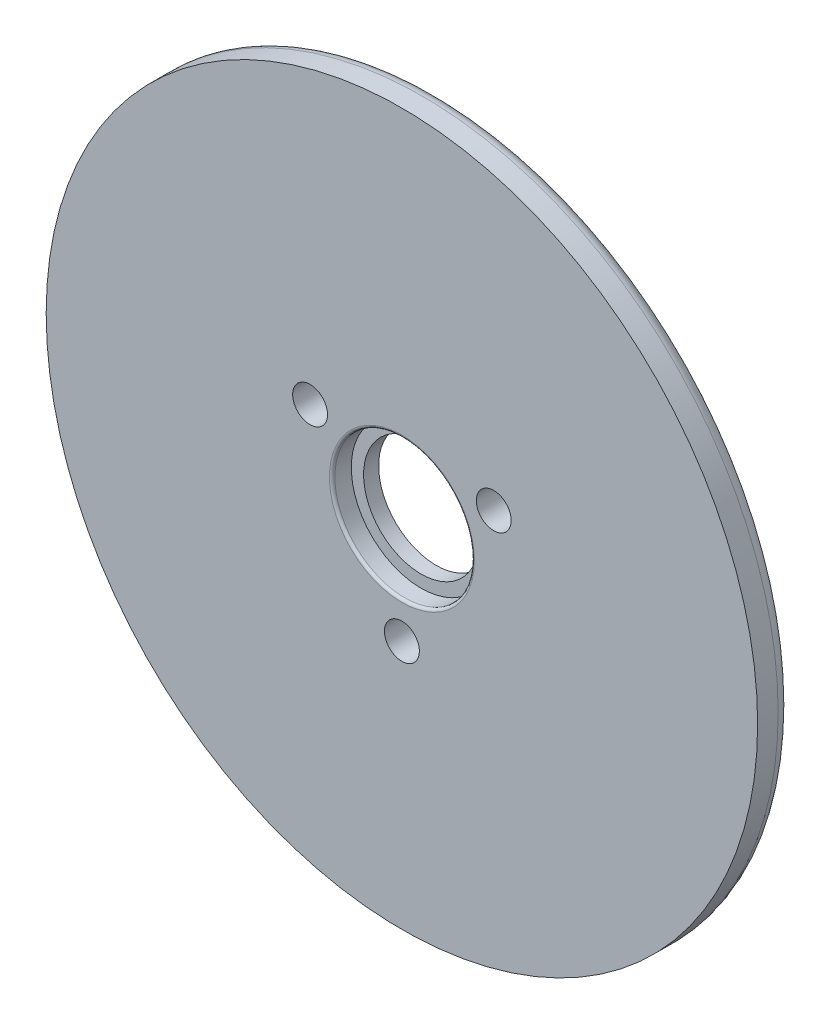
ISO-10303-21;
HEADER;
FILE_DESCRIPTION(('STEP AP214'),'2;1');
FILE_NAME('part.step','',(''),(''),'','','');
FILE_SCHEMA(('AUTOMOTIVE_DESIGN { 1 0 10303 214 1 1 1 1 }'));
ENDSEC;
DATA;
#1=APPLICATION_CONTEXT('core data for automotive mechanical design processes');
#2=APPLICATION_PROTOCOL_DEFINITION('international standard','automotive_design',2000,#1);
#3=PRODUCT_CONTEXT('',#1,'mechanical');
#4=PRODUCT('Part','Part','',(#3));
#5=PRODUCT_RELATED_PRODUCT_CATEGORY('part','',(#4));
#6=PRODUCT_DEFINITION_FORMATION('','',#4);
#7=PRODUCT_DEFINITION_CONTEXT('part definition',#1,'design');
#8=PRODUCT_DEFINITION('design','',#6,#7);
#9=PRODUCT_DEFINITION_SHAPE('','',#8);
#10=(LENGTH_UNIT() NAMED_UNIT(*) SI_UNIT(.MILLI.,.METRE.));
#11=(NAMED_UNIT(*) PLANE_ANGLE_UNIT() SI_UNIT($,.RADIAN.));
#12=(NAMED_UNIT(*) SI_UNIT($,.STERADIAN.) SOLID_ANGLE_UNIT());
#13=UNCERTAINTY_MEASURE_WITH_UNIT(LENGTH_MEASURE(1.E-05),#10,'distance_accuracy_value','');
#14=(GEOMETRIC_REPRESENTATION_CONTEXT(3) GLOBAL_UNCERTAINTY_ASSIGNED_CONTEXT((#13)) GLOBAL_UNIT_ASSIGNED_CONTEXT((#10,
#11,#12)) REPRESENTATION_CONTEXT('',''));
#15=CARTESIAN_POINT('',(0.,0.,0.));
#16=DIRECTION('',(0.,0.,1.));
#17=DIRECTION('',(1.,0.,0.));
#18=AXIS2_PLACEMENT_3D('',#15,#16,#17);
#19=CARTESIAN_POINT('',(0.,0.,2.5));
#20=DIRECTION('',(0.,0.,-1.));
#21=DIRECTION('',(-1.,0.,0.));
#22=AXIS2_PLACEMENT_3D('',#19,#20,#21);
#23=CYLINDRICAL_SURFACE('',#22,4.2);
#24=CARTESIAN_POINT('',(0.,0.,0.));
#25=DIRECTION('',(0.,0.,1.));
#26=DIRECTION('',(1.,0.,0.));
#27=AXIS2_PLACEMENT_3D('',#24,#25,#26);
#28=CIRCLE('',#27,4.2);
#29=CARTESIAN_POINT('',(4.2,0.,0.));
#30=VERTEX_POINT('',#29);
#31=EDGE_CURVE('E67',#30,#30,#28,.T.);
#32=ORIENTED_EDGE('',*,*,#31,.F.);
#33=EDGE_LOOP('',(#32));
#34=FACE_BOUND('',#33,.T.);
#35=CARTESIAN_POINT('',(0.,0.,1.1));
#36=DIRECTION('',(0.,0.,1.));
#37=DIRECTION('',(1.,0.,0.));
#38=AXIS2_PLACEMENT_3D('',#35,#36,#37);
#39=CIRCLE('',#38,4.2);
#40=CARTESIAN_POINT('',(4.2,0.,1.1));
#41=VERTEX_POINT('',#40);
#42=EDGE_CURVE('E60',#41,#41,#39,.T.);
#43=ORIENTED_EDGE('',*,*,#42,.T.);
#44=EDGE_LOOP('',(#43));
#45=FACE_BOUND('',#44,.T.);
#46=ADVANCED_FACE('F39',(#34,#45),#23,.F.);
#47=CARTESIAN_POINT('',(0.,0.,2.5));
#48=DIRECTION('',(0.,0.,1.));
#49=DIRECTION('',(1.,0.,0.));
#50=AXIS2_PLACEMENT_3D('',#47,#48,#49);
#51=PLANE('',#50);
#52=CARTESIAN_POINT('',(0.,0.,2.5));
#53=DIRECTION('',(0.,0.,1.));
#54=DIRECTION('',(1.,0.,0.));
#55=AXIS2_PLACEMENT_3D('',#52,#53,#54);
#56=CIRCLE('',#55,5.3);
#57=CARTESIAN_POINT('',(5.3,0.,2.5));
#58=VERTEX_POINT('',#57);
#59=EDGE_CURVE('E50',#58,#58,#56,.F.);
#60=ORIENTED_EDGE('',*,*,#59,.T.);
#61=EDGE_LOOP('',(#60));
#62=FACE_BOUND('',#61,.T.);
#63=CARTESIAN_POINT('',(-6.7116968793294,3.875,2.5));
#64=DIRECTION('',(0.,0.,1.));
#65=DIRECTION('',(1.,0.,0.));
#66=AXIS2_PLACEMENT_3D('',#63,#64,#65);
#67=CIRCLE('',#66,1.275);
#68=CARTESIAN_POINT('',(-5.4366968793294,3.875,2.5));
#69=VERTEX_POINT('',#68);
#70=EDGE_CURVE('E74',#69,#69,#67,.T.);
#71=ORIENTED_EDGE('',*,*,#70,.F.);
#72=EDGE_LOOP('',(#71));
#73=FACE_BOUND('',#72,.T.);
#74=CARTESIAN_POINT('',(0.,0.,2.5));
#75=DIRECTION('',(0.,0.,1.));
#76=DIRECTION('',(1.,0.,0.));
#77=AXIS2_PLACEMENT_3D('',#74,#75,#76);
#78=CIRCLE('',#77,26.);
#79=CARTESIAN_POINT('',(26.,0.,2.5));
#80=VERTEX_POINT('',#79);
#81=EDGE_CURVE('E59',#80,#80,#78,.T.);
#82=ORIENTED_EDGE('',*,*,#81,.T.);
#83=EDGE_LOOP('',(#82));
#84=FACE_BOUND('',#83,.T.);
#85=CARTESIAN_POINT('',(0.,-7.75,2.5));
#86=DIRECTION('',(0.,0.,1.));
#87=DIRECTION('',(1.,0.,0.));
#88=AXIS2_PLACEMENT_3D('',#85,#86,#87);
#89=CIRCLE('',#88,1.275);
#90=CARTESIAN_POINT('',(1.275,-7.75,2.5));
#91=VERTEX_POINT('',#90);
#92=EDGE_CURVE('E70',#91,#91,#89,.T.);
#93=ORIENTED_EDGE('',*,*,#92,.F.);
#94=EDGE_LOOP('',(#93));
#95=FACE_BOUND('',#94,.T.);
#96=CARTESIAN_POINT('',(6.7116968793294,3.875,2.5));
#97=DIRECTION('',(0.,0.,1.));
#98=DIRECTION('',(1.,0.,0.));
#99=AXIS2_PLACEMENT_3D('',#96,#97,#98);
#100=CIRCLE('',#99,1.275);
#101=CARTESIAN_POINT('',(7.9866968793294,3.875,2.5));
#102=VERTEX_POINT('',#101);
#103=EDGE_CURVE('E80',#102,#102,#100,.T.);
#104=ORIENTED_EDGE('',*,*,#103,.F.);
#105=EDGE_LOOP('',(#104));
#106=FACE_BOUND('',#105,.T.);
#107=ADVANCED_FACE('F108',(#62,#73,#84,#95,#106),#51,.T.);
#108=CARTESIAN_POINT('',(0.,0.,0.));
#109=DIRECTION('',(0.,0.,1.));
#110=DIRECTION('',(1.,0.,0.));
#111=AXIS2_PLACEMENT_3D('',#108,#109,#110);
#112=PLANE('',#111);
#113=CARTESIAN_POINT('',(0.,0.,0.));
#114=DIRECTION('',(0.,0.,1.));
#115=DIRECTION('',(1.,0.,0.));
#116=AXIS2_PLACEMENT_3D('',#113,#114,#115);
#117=CIRCLE('',#116,25.);
#118=CARTESIAN_POINT('',(25.,0.,0.));
#119=VERTEX_POINT('',#118);
#120=EDGE_CURVE('E10',#119,#119,#117,.F.);
#121=ORIENTED_EDGE('',*,*,#120,.T.);
#122=EDGE_LOOP('',(#121));
#123=FACE_BOUND('',#122,.T.);
#124=ORIENTED_EDGE('',*,*,#31,.T.);
#125=EDGE_LOOP('',(#124));
#126=FACE_BOUND('',#125,.T.);
#127=CARTESIAN_POINT('',(0.,-7.75,0.));
#128=DIRECTION('',(0.,0.,1.));
#129=DIRECTION('',(1.,0.,0.));
#130=AXIS2_PLACEMENT_3D('',#127,#128,#129);
#131=CIRCLE('',#130,1.275);
#132=CARTESIAN_POINT('',(1.275,-7.75,0.));
#133=VERTEX_POINT('',#132);
#134=EDGE_CURVE('E71',#133,#133,#131,.T.);
#135=ORIENTED_EDGE('',*,*,#134,.T.);
#136=EDGE_LOOP('',(#135));
#137=FACE_BOUND('',#136,.T.);
#138=CARTESIAN_POINT('',(-6.7116968793294,3.875,0.));
#139=DIRECTION('',(0.,0.,1.));
#140=DIRECTION('',(1.,0.,0.));
#141=AXIS2_PLACEMENT_3D('',#138,#139,#140);
#142=CIRCLE('',#141,1.275);
#143=CARTESIAN_POINT('',(-5.4366968793294,3.875,0.));
#144=VERTEX_POINT('',#143);
#145=EDGE_CURVE('E77',#144,#144,#142,.T.);
#146=ORIENTED_EDGE('',*,*,#145,.T.);
#147=EDGE_LOOP('',(#146));
#148=FACE_BOUND('',#147,.T.);
#149=CARTESIAN_POINT('',(6.7116968793294,3.875,0.));
#150=DIRECTION('',(0.,0.,1.));
#151=DIRECTION('',(1.,0.,0.));
#152=AXIS2_PLACEMENT_3D('',#149,#150,#151);
#153=CIRCLE('',#152,1.275);
#154=CARTESIAN_POINT('',(7.9866968793294,3.875,0.));
#155=VERTEX_POINT('',#154);
#156=EDGE_CURVE('E63',#155,#155,#153,.T.);
#157=ORIENTED_EDGE('',*,*,#156,.T.);
#158=EDGE_LOOP('',(#157));
#159=FACE_BOUND('',#158,.T.);
#160=ADVANCED_FACE('F114',(#123,#126,#137,#148,#159),#112,.F.);
#161=CARTESIAN_POINT('',(0.,0.,2.5));
#162=DIRECTION('',(0.,0.,-1.));
#163=DIRECTION('',(-1.,0.,0.));
#164=AXIS2_PLACEMENT_3D('',#161,#162,#163);
#165=CYLINDRICAL_SURFACE('',#164,26.);
#166=CARTESIAN_POINT('',(0.,0.,1.));
#167=DIRECTION('',(0.,0.,1.));
#168=DIRECTION('',(1.,0.,0.));
#169=AXIS2_PLACEMENT_3D('',#166,#167,#168);
#170=CIRCLE('',#169,26.);
#171=CARTESIAN_POINT('',(26.,0.,1.));
#172=VERTEX_POINT('',#171);
#173=EDGE_CURVE('E46',#172,#172,#170,.T.);
#174=ORIENTED_EDGE('',*,*,#173,.T.);
#175=EDGE_LOOP('',(#174));
#176=FACE_BOUND('',#175,.T.);
#177=ORIENTED_EDGE('',*,*,#81,.F.);
#178=EDGE_LOOP('',(#177));
#179=FACE_BOUND('',#178,.T.);
#180=ADVANCED_FACE('F125',(#176,#179),#165,.T.);
#181=CARTESIAN_POINT('',(0.,-7.75,2.5));
#182=DIRECTION('',(0.,0.,-1.));
#183=DIRECTION('',(-1.,0.,0.));
#184=AXIS2_PLACEMENT_3D('',#181,#182,#183);
#185=CYLINDRICAL_SURFACE('',#184,1.275);
#186=ORIENTED_EDGE('',*,*,#92,.T.);
#187=EDGE_LOOP('',(#186));
#188=FACE_BOUND('',#187,.T.);
#189=ORIENTED_EDGE('',*,*,#134,.F.);
#190=EDGE_LOOP('',(#189));
#191=FACE_BOUND('',#190,.T.);
#192=ADVANCED_FACE('F120',(#188,#191),#185,.F.);
#193=CARTESIAN_POINT('',(-6.7116968793294,3.875,2.5));
#194=DIRECTION('',(0.,0.,-1.));
#195=DIRECTION('',(-1.,0.,0.));
#196=AXIS2_PLACEMENT_3D('',#193,#194,#195);
#197=CYLINDRICAL_SURFACE('',#196,1.275);
#198=ORIENTED_EDGE('',*,*,#70,.T.);
#199=EDGE_LOOP('',(#198));
#200=FACE_BOUND('',#199,.T.);
#201=ORIENTED_EDGE('',*,*,#145,.F.);
#202=EDGE_LOOP('',(#201));
#203=FACE_BOUND('',#202,.T.);
#204=ADVANCED_FACE('F104',(#200,#203),#197,.F.);
#205=CARTESIAN_POINT('',(6.7116968793294,3.875,2.5));
#206=DIRECTION('',(0.,0.,-1.));
#207=DIRECTION('',(-1.,0.,0.));
#208=AXIS2_PLACEMENT_3D('',#205,#206,#207);
#209=CYLINDRICAL_SURFACE('',#208,1.275);
#210=ORIENTED_EDGE('',*,*,#103,.T.);
#211=EDGE_LOOP('',(#210));
#212=FACE_BOUND('',#211,.T.);
#213=ORIENTED_EDGE('',*,*,#156,.F.);
#214=EDGE_LOOP('',(#213));
#215=FACE_BOUND('',#214,.T.);
#216=ADVANCED_FACE('F94',(#212,#215),#209,.F.);
#217=CARTESIAN_POINT('',(0.,0.,1.1));
#218=DIRECTION('',(0.,0.,1.));
#219=DIRECTION('',(1.,0.,0.));
#220=AXIS2_PLACEMENT_3D('',#217,#218,#219);
#221=CYLINDRICAL_SURFACE('',#220,5.1);
#222=CARTESIAN_POINT('',(0.,0.,2.3));
#223=DIRECTION('',(0.,0.,1.));
#224=DIRECTION('',(1.,0.,0.));
#225=AXIS2_PLACEMENT_3D('',#222,#223,#224);
#226=CIRCLE('',#225,5.1);
#227=CARTESIAN_POINT('',(5.1,0.,2.3));
#228=VERTEX_POINT('',#227);
#229=EDGE_CURVE('E54',#228,#228,#226,.T.);
#230=ORIENTED_EDGE('',*,*,#229,.T.);
#231=EDGE_LOOP('',(#230));
#232=FACE_BOUND('',#231,.T.);
#233=CARTESIAN_POINT('',(0.,0.,1.1));
#234=DIRECTION('',(0.,0.,1.));
#235=DIRECTION('',(1.,0.,0.));
#236=AXIS2_PLACEMENT_3D('',#233,#234,#235);
#237=CIRCLE('',#236,5.1);
#238=CARTESIAN_POINT('',(5.1,0.,1.1));
#239=VERTEX_POINT('',#238);
#240=EDGE_CURVE('E64',#239,#239,#237,.T.);
#241=ORIENTED_EDGE('',*,*,#240,.F.);
#242=EDGE_LOOP('',(#241));
#243=FACE_BOUND('',#242,.T.);
#244=ADVANCED_FACE('F92',(#232,#243),#221,.F.);
#245=CARTESIAN_POINT('',(0.,0.,1.1));
#246=DIRECTION('',(0.,0.,1.));
#247=DIRECTION('',(1.,0.,0.));
#248=AXIS2_PLACEMENT_3D('',#245,#246,#247);
#249=PLANE('',#248);
#250=ORIENTED_EDGE('',*,*,#42,.F.);
#251=EDGE_LOOP('',(#250));
#252=FACE_BOUND('',#251,.T.);
#253=ORIENTED_EDGE('',*,*,#240,.T.);
#254=EDGE_LOOP('',(#253));
#255=FACE_BOUND('',#254,.T.);
#256=ADVANCED_FACE('F90',(#252,#255),#249,.T.);
#257=CARTESIAN_POINT('',(0.,0.,2.3));
#258=DIRECTION('',(0.,0.,1.));
#259=DIRECTION('',(1.,0.,0.));
#260=AXIS2_PLACEMENT_3D('',#257,#258,#259);
#261=TOROIDAL_SURFACE('',#260,5.3,0.2);
#262=ORIENTED_EDGE('',*,*,#59,.F.);
#263=EDGE_LOOP('',(#262));
#264=FACE_BOUND('',#263,.T.);
#265=ORIENTED_EDGE('',*,*,#229,.F.);
#266=EDGE_LOOP('',(#265));
#267=FACE_BOUND('',#266,.T.);
#268=ADVANCED_FACE('F101',(#264,#267),#261,.T.);
#269=CARTESIAN_POINT('',(0.,0.,1.));
#270=DIRECTION('',(0.,0.,1.));
#271=DIRECTION('',(1.,0.,0.));
#272=AXIS2_PLACEMENT_3D('',#269,#270,#271);
#273=TOROIDAL_SURFACE('',#272,25.,1.);
#274=ORIENTED_EDGE('',*,*,#120,.F.);
#275=EDGE_LOOP('',(#274));
#276=FACE_BOUND('',#275,.T.);
#277=ORIENTED_EDGE('',*,*,#173,.F.);
#278=EDGE_LOOP('',(#277));
#279=FACE_BOUND('',#278,.T.);
#280=ADVANCED_FACE('F41',(#276,#279),#273,.T.);
#281=CLOSED_SHELL('',(#46,#107,#160,#180,#192,#204,#216,#244,#256,#268,#280));
#282=MANIFOLD_SOLID_BREP('B2',#281);
#283=ADVANCED_BREP_SHAPE_REPRESENTATION('',(#18,#282),#14);
#284=SHAPE_DEFINITION_REPRESENTATION(#9,#283);
ENDSEC;
END-ISO-10303-21;
